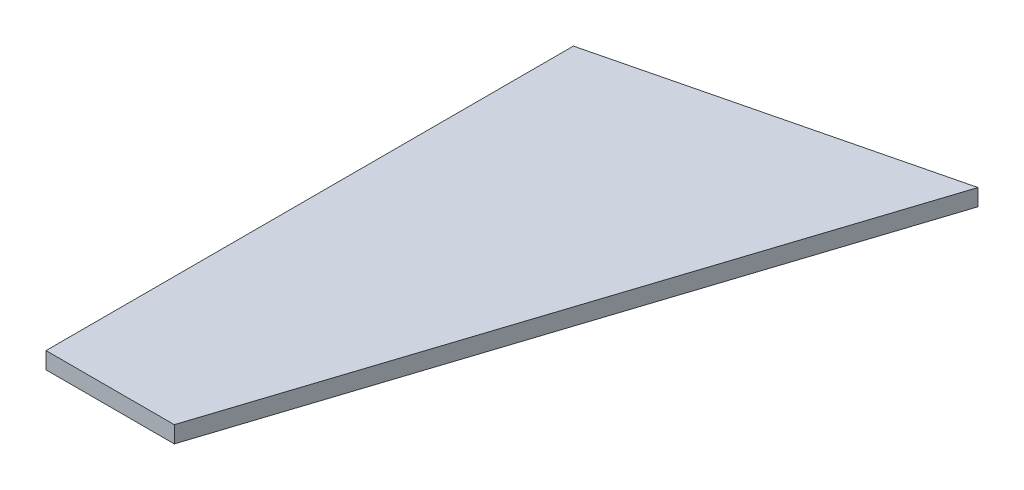
ISO-10303-21;
HEADER;
FILE_DESCRIPTION(('STEP AP214'),'2;1');
FILE_NAME('part.step','',(''),(''),'','','');
FILE_SCHEMA(('AUTOMOTIVE_DESIGN { 1 0 10303 214 1 1 1 1 }'));
ENDSEC;
DATA;
#1=APPLICATION_CONTEXT('core data for automotive mechanical design processes');
#2=APPLICATION_PROTOCOL_DEFINITION('international standard','automotive_design',2000,#1);
#3=PRODUCT_CONTEXT('',#1,'mechanical');
#4=PRODUCT('Part','Part','',(#3));
#5=PRODUCT_RELATED_PRODUCT_CATEGORY('part','',(#4));
#6=PRODUCT_DEFINITION_FORMATION('','',#4);
#7=PRODUCT_DEFINITION_CONTEXT('part definition',#1,'design');
#8=PRODUCT_DEFINITION('design','',#6,#7);
#9=PRODUCT_DEFINITION_SHAPE('','',#8);
#10=(LENGTH_UNIT() NAMED_UNIT(*) SI_UNIT(.MILLI.,.METRE.));
#11=(NAMED_UNIT(*) PLANE_ANGLE_UNIT() SI_UNIT($,.RADIAN.));
#12=(NAMED_UNIT(*) SI_UNIT($,.STERADIAN.) SOLID_ANGLE_UNIT());
#13=UNCERTAINTY_MEASURE_WITH_UNIT(LENGTH_MEASURE(1.E-05),#10,'distance_accuracy_value','');
#14=(GEOMETRIC_REPRESENTATION_CONTEXT(3) GLOBAL_UNCERTAINTY_ASSIGNED_CONTEXT((#13)) GLOBAL_UNIT_ASSIGNED_CONTEXT((#10,
#11,#12)) REPRESENTATION_CONTEXT('',''));
#15=CARTESIAN_POINT('',(0.,0.,0.));
#16=DIRECTION('',(0.,0.,1.));
#17=DIRECTION('',(1.,0.,0.));
#18=AXIS2_PLACEMENT_3D('',#15,#16,#17);
#19=CARTESIAN_POINT('',(38.9040446994585,2.,-72.7353240710092));
#20=DIRECTION('',(-0.951435634646907,0.,-0.307847743412287));
#21=DIRECTION('',(-0.307847743412287,0.,0.951435634646907));
#22=AXIS2_PLACEMENT_3D('',#19,#20,#21);
#23=PLANE('',#22);
#24=DIRECTION('',(0.307847743412287,0.,-0.951435634646907));
#25=VECTOR('',#24,1.);
#26=CARTESIAN_POINT('',(38.9040446994585,0.,-72.7353240710092));
#27=LINE('',#26,#25);
#28=CARTESIAN_POINT('',(15.3697092528663,0.,0.));
#29=VERTEX_POINT('',#28);
#30=CARTESIAN_POINT('',(38.9040446994585,0.,-72.7353240710092));
#31=VERTEX_POINT('',#30);
#32=EDGE_CURVE('E107',#29,#31,#27,.T.);
#33=ORIENTED_EDGE('',*,*,#32,.T.);
#34=DIRECTION('',(0.,-1.,0.));
#35=VECTOR('',#34,1.);
#36=CARTESIAN_POINT('',(38.9040446994585,2.,-72.7353240710092));
#37=LINE('',#36,#35);
#38=CARTESIAN_POINT('',(38.9040446994585,2.,-72.7353240710092));
#39=VERTEX_POINT('',#38);
#40=EDGE_CURVE('E11',#39,#31,#37,.T.);
#41=ORIENTED_EDGE('',*,*,#40,.F.);
#42=DIRECTION('',(0.307847743412287,0.,-0.951435634646907));
#43=VECTOR('',#42,1.);
#44=CARTESIAN_POINT('',(38.9040446994585,2.,-72.7353240710092));
#45=LINE('',#44,#43);
#46=CARTESIAN_POINT('',(15.3697092528663,2.,0.));
#47=VERTEX_POINT('',#46);
#48=EDGE_CURVE('E91',#47,#39,#45,.T.);
#49=ORIENTED_EDGE('',*,*,#48,.F.);
#50=DIRECTION('',(0.,-1.,0.));
#51=VECTOR('',#50,1.);
#52=CARTESIAN_POINT('',(15.3697092528663,2.,0.));
#53=LINE('',#52,#51);
#54=EDGE_CURVE('E103',#47,#29,#53,.T.);
#55=ORIENTED_EDGE('',*,*,#54,.T.);
#56=EDGE_LOOP('',(#33,#41,#49,#55));
#57=FACE_BOUND('',#56,.T.);
#58=ADVANCED_FACE('F39',(#57),#23,.F.);
#59=CARTESIAN_POINT('',(38.9040446994585,2.,-72.7353240710092));
#60=DIRECTION('',(0.238597127604062,0.,0.971118638838268));
#61=DIRECTION('',(0.971118638838268,0.,-0.238597127604062));
#62=AXIS2_PLACEMENT_3D('',#59,#60,#61);
#63=PLANE('',#62);
#64=DIRECTION('',(-0.971118638838268,0.,0.238597127604062));
#65=VECTOR('',#64,1.);
#66=CARTESIAN_POINT('',(38.9040446994585,0.,-72.7353240710092));
#67=LINE('',#66,#65);
#68=CARTESIAN_POINT('',(0.,0.,-63.1768695771534));
#69=VERTEX_POINT('',#68);
#70=EDGE_CURVE('E96',#31,#69,#67,.T.);
#71=ORIENTED_EDGE('',*,*,#70,.T.);
#72=DIRECTION('',(0.,-1.,0.));
#73=VECTOR('',#72,1.);
#74=CARTESIAN_POINT('',(0.,2.,-63.1768695771534));
#75=LINE('',#74,#73);
#76=CARTESIAN_POINT('',(0.,2.,-63.1768695771534));
#77=VERTEX_POINT('',#76);
#78=EDGE_CURVE('E48',#77,#69,#75,.T.);
#79=ORIENTED_EDGE('',*,*,#78,.F.);
#80=DIRECTION('',(-0.971118638838268,0.,0.238597127604062));
#81=VECTOR('',#80,1.);
#82=CARTESIAN_POINT('',(38.9040446994585,2.,-72.7353240710092));
#83=LINE('',#82,#81);
#84=EDGE_CURVE('E86',#39,#77,#83,.T.);
#85=ORIENTED_EDGE('',*,*,#84,.F.);
#86=ORIENTED_EDGE('',*,*,#40,.T.);
#87=EDGE_LOOP('',(#71,#79,#85,#86));
#88=FACE_BOUND('',#87,.T.);
#89=ADVANCED_FACE('F95',(#88),#63,.F.);
#90=CARTESIAN_POINT('',(0.,2.,-63.1768695771534));
#91=DIRECTION('',(1.,0.,0.));
#92=DIRECTION('',(0.,0.,-1.));
#93=AXIS2_PLACEMENT_3D('',#90,#91,#92);
#94=PLANE('',#93);
#95=DIRECTION('',(0.,0.,1.));
#96=VECTOR('',#95,1.);
#97=CARTESIAN_POINT('',(0.,0.,-63.1768695771534));
#98=LINE('',#97,#96);
#99=CARTESIAN_POINT('',(0.,0.,0.));
#100=VERTEX_POINT('',#99);
#101=EDGE_CURVE('E73',#69,#100,#98,.T.);
#102=ORIENTED_EDGE('',*,*,#101,.T.);
#103=DIRECTION('',(0.,-1.,0.));
#104=VECTOR('',#103,1.);
#105=CARTESIAN_POINT('',(0.,2.,0.));
#106=LINE('',#105,#104);
#107=CARTESIAN_POINT('',(0.,2.,0.));
#108=VERTEX_POINT('',#107);
#109=EDGE_CURVE('E98',#108,#100,#106,.T.);
#110=ORIENTED_EDGE('',*,*,#109,.F.);
#111=DIRECTION('',(0.,0.,1.));
#112=VECTOR('',#111,1.);
#113=CARTESIAN_POINT('',(0.,2.,-63.1768695771534));
#114=LINE('',#113,#112);
#115=EDGE_CURVE('E89',#77,#108,#114,.T.);
#116=ORIENTED_EDGE('',*,*,#115,.F.);
#117=ORIENTED_EDGE('',*,*,#78,.T.);
#118=EDGE_LOOP('',(#102,#110,#116,#117));
#119=FACE_BOUND('',#118,.T.);
#120=ADVANCED_FACE('F99',(#119),#94,.F.);
#121=CARTESIAN_POINT('',(0.,2.,0.));
#122=DIRECTION('',(0.,0.,-1.));
#123=DIRECTION('',(-1.,0.,0.));
#124=AXIS2_PLACEMENT_3D('',#121,#122,#123);
#125=PLANE('',#124);
#126=DIRECTION('',(1.,0.,0.));
#127=VECTOR('',#126,1.);
#128=CARTESIAN_POINT('',(0.,0.,0.));
#129=LINE('',#128,#127);
#130=EDGE_CURVE('E79',#100,#29,#129,.T.);
#131=ORIENTED_EDGE('',*,*,#130,.T.);
#132=ORIENTED_EDGE('',*,*,#54,.F.);
#133=DIRECTION('',(1.,0.,0.));
#134=VECTOR('',#133,1.);
#135=CARTESIAN_POINT('',(0.,2.,0.));
#136=LINE('',#135,#134);
#137=EDGE_CURVE('E56',#108,#47,#136,.T.);
#138=ORIENTED_EDGE('',*,*,#137,.F.);
#139=ORIENTED_EDGE('',*,*,#109,.T.);
#140=EDGE_LOOP('',(#131,#132,#138,#139));
#141=FACE_BOUND('',#140,.T.);
#142=ADVANCED_FACE('F120',(#141),#125,.F.);
#143=CARTESIAN_POINT('',(0.,2.,0.));
#144=DIRECTION('',(0.,1.,0.));
#145=DIRECTION('',(0.,0.,1.));
#146=AXIS2_PLACEMENT_3D('',#143,#144,#145);
#147=PLANE('',#146);
#148=ORIENTED_EDGE('',*,*,#48,.T.);
#149=ORIENTED_EDGE('',*,*,#84,.T.);
#150=ORIENTED_EDGE('',*,*,#115,.T.);
#151=ORIENTED_EDGE('',*,*,#137,.T.);
#152=EDGE_LOOP('',(#148,#149,#150,#151));
#153=FACE_BOUND('',#152,.T.);
#154=ADVANCED_FACE('F87',(#153),#147,.T.);
#155=CARTESIAN_POINT('',(0.,0.,0.));
#156=DIRECTION('',(0.,1.,0.));
#157=DIRECTION('',(0.,0.,1.));
#158=AXIS2_PLACEMENT_3D('',#155,#156,#157);
#159=PLANE('',#158);
#160=ORIENTED_EDGE('',*,*,#32,.F.);
#161=ORIENTED_EDGE('',*,*,#130,.F.);
#162=ORIENTED_EDGE('',*,*,#101,.F.);
#163=ORIENTED_EDGE('',*,*,#70,.F.);
#164=EDGE_LOOP('',(#160,#161,#162,#163));
#165=FACE_BOUND('',#164,.T.);
#166=ADVANCED_FACE('F123',(#165),#159,.F.);
#167=CLOSED_SHELL('',(#58,#89,#120,#142,#154,#166));
#168=MANIFOLD_SOLID_BREP('B2',#167);
#169=ADVANCED_BREP_SHAPE_REPRESENTATION('',(#18,#168),#14);
#170=SHAPE_DEFINITION_REPRESENTATION(#9,#169);
ENDSEC;
END-ISO-10303-21;
